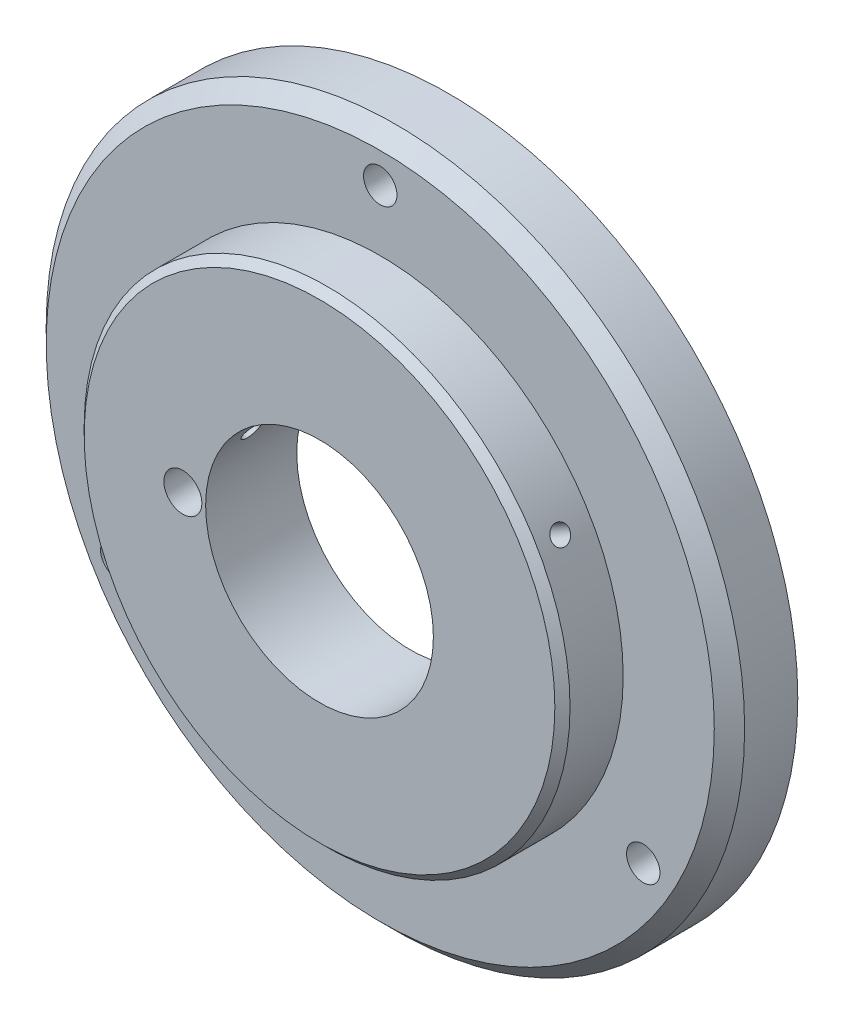
ISO-10303-21;
HEADER;
FILE_DESCRIPTION(('STEP AP214'),'2;1');
FILE_NAME('part.step','',(''),(''),'','','');
FILE_SCHEMA(('AUTOMOTIVE_DESIGN { 1 0 10303 214 1 1 1 1 }'));
ENDSEC;
DATA;
#1=APPLICATION_CONTEXT('core data for automotive mechanical design processes');
#2=APPLICATION_PROTOCOL_DEFINITION('international standard','automotive_design',2000,#1);
#3=PRODUCT_CONTEXT('',#1,'mechanical');
#4=PRODUCT('Part','Part','',(#3));
#5=PRODUCT_RELATED_PRODUCT_CATEGORY('part','',(#4));
#6=PRODUCT_DEFINITION_FORMATION('','',#4);
#7=PRODUCT_DEFINITION_CONTEXT('part definition',#1,'design');
#8=PRODUCT_DEFINITION('design','',#6,#7);
#9=PRODUCT_DEFINITION_SHAPE('','',#8);
#10=(LENGTH_UNIT() NAMED_UNIT(*) SI_UNIT(.MILLI.,.METRE.));
#11=(NAMED_UNIT(*) PLANE_ANGLE_UNIT() SI_UNIT($,.RADIAN.));
#12=(NAMED_UNIT(*) SI_UNIT($,.STERADIAN.) SOLID_ANGLE_UNIT());
#13=UNCERTAINTY_MEASURE_WITH_UNIT(LENGTH_MEASURE(1.E-05),#10,'distance_accuracy_value','');
#14=(GEOMETRIC_REPRESENTATION_CONTEXT(3) GLOBAL_UNCERTAINTY_ASSIGNED_CONTEXT((#13)) GLOBAL_UNIT_ASSIGNED_CONTEXT((#10,
#11,#12)) REPRESENTATION_CONTEXT('',''));
#15=CARTESIAN_POINT('',(0.,0.,0.));
#16=DIRECTION('',(0.,0.,1.));
#17=DIRECTION('',(1.,0.,0.));
#18=AXIS2_PLACEMENT_3D('',#15,#16,#17);
#19=CARTESIAN_POINT('',(0.,0.,9.));
#20=DIRECTION('',(0.,0.,1.));
#21=DIRECTION('',(1.,0.,0.));
#22=AXIS2_PLACEMENT_3D('',#19,#20,#21);
#23=PLANE('',#22);
#24=CARTESIAN_POINT('',(0.,0.,9.));
#25=DIRECTION('',(0.,0.,1.));
#26=DIRECTION('',(1.,0.,0.));
#27=AXIS2_PLACEMENT_3D('',#24,#25,#26);
#28=CIRCLE('',#27,44.);
#29=CARTESIAN_POINT('',(44.,0.,9.));
#30=VERTEX_POINT('',#29);
#31=EDGE_CURVE('E51',#30,#30,#28,.T.);
#32=ORIENTED_EDGE('',*,*,#31,.T.);
#33=EDGE_LOOP('',(#32));
#34=FACE_BOUND('',#33,.T.);
#35=CARTESIAN_POINT('',(-34.6410161513777,-19.9999999999997,9.));
#36=DIRECTION('',(0.,0.,1.));
#37=DIRECTION('',(-0.499999999999992,0.866025403784443,0.));
#38=AXIS2_PLACEMENT_3D('',#35,#36,#37);
#39=CIRCLE('',#38,2.2);
#40=CARTESIAN_POINT('',(-35.7410161513777,-18.0947441116739,9.));
#41=VERTEX_POINT('',#40);
#42=EDGE_CURVE('E85',#41,#41,#39,.T.);
#43=ORIENTED_EDGE('',*,*,#42,.F.);
#44=EDGE_LOOP('',(#43));
#45=FACE_BOUND('',#44,.T.);
#46=CARTESIAN_POINT('',(34.6410161513775,-20.0000000000002,9.));
#47=DIRECTION('',(0.,0.,1.));
#48=DIRECTION('',(-0.500000000000004,-0.866025403784436,0.));
#49=AXIS2_PLACEMENT_3D('',#46,#47,#48);
#50=CIRCLE('',#49,2.2);
#51=CARTESIAN_POINT('',(33.5410161513775,-21.9052558883259,9.));
#52=VERTEX_POINT('',#51);
#53=EDGE_CURVE('E79',#52,#52,#50,.T.);
#54=ORIENTED_EDGE('',*,*,#53,.F.);
#55=EDGE_LOOP('',(#54));
#56=FACE_BOUND('',#55,.T.);
#57=CARTESIAN_POINT('',(0.,40.,9.));
#58=DIRECTION('',(0.,0.,1.));
#59=DIRECTION('',(1.,0.,0.));
#60=AXIS2_PLACEMENT_3D('',#57,#58,#59);
#61=CIRCLE('',#60,2.2);
#62=CARTESIAN_POINT('',(2.2,40.,9.));
#63=VERTEX_POINT('',#62);
#64=EDGE_CURVE('E73',#63,#63,#61,.T.);
#65=ORIENTED_EDGE('',*,*,#64,.F.);
#66=EDGE_LOOP('',(#65));
#67=FACE_BOUND('',#66,.T.);
#68=CARTESIAN_POINT('',(0.,0.,9.));
#69=DIRECTION('',(0.,0.,1.));
#70=DIRECTION('',(1.,0.,0.));
#71=AXIS2_PLACEMENT_3D('',#68,#69,#70);
#72=CIRCLE('',#71,32.);
#73=CARTESIAN_POINT('',(32.,0.,9.));
#74=VERTEX_POINT('',#73);
#75=EDGE_CURVE('E57',#74,#74,#72,.T.);
#76=ORIENTED_EDGE('',*,*,#75,.F.);
#77=EDGE_LOOP('',(#76));
#78=FACE_BOUND('',#77,.T.);
#79=ADVANCED_FACE('F34',(#34,#45,#56,#67,#78),#23,.T.);
#80=CARTESIAN_POINT('',(0.,0.,9.));
#81=DIRECTION('',(0.,0.,-1.));
#82=DIRECTION('',(-1.,0.,0.));
#83=AXIS2_PLACEMENT_3D('',#80,#81,#82);
#84=CYLINDRICAL_SURFACE('',#83,46.);
#85=CARTESIAN_POINT('',(0.,0.,7.));
#86=DIRECTION('',(0.,0.,1.));
#87=DIRECTION('',(1.,0.,0.));
#88=AXIS2_PLACEMENT_3D('',#85,#86,#87);
#89=CIRCLE('',#88,46.);
#90=CARTESIAN_POINT('',(46.,0.,7.));
#91=VERTEX_POINT('',#90);
#92=EDGE_CURVE('E46',#91,#91,#89,.F.);
#93=ORIENTED_EDGE('',*,*,#92,.T.);
#94=EDGE_LOOP('',(#93));
#95=FACE_BOUND('',#94,.T.);
#96=CARTESIAN_POINT('',(0.,0.,0.));
#97=DIRECTION('',(0.,0.,1.));
#98=DIRECTION('',(1.,0.,0.));
#99=AXIS2_PLACEMENT_3D('',#96,#97,#98);
#100=CIRCLE('',#99,46.);
#101=CARTESIAN_POINT('',(46.,0.,0.));
#102=VERTEX_POINT('',#101);
#103=EDGE_CURVE('E54',#102,#102,#100,.T.);
#104=ORIENTED_EDGE('',*,*,#103,.T.);
#105=EDGE_LOOP('',(#104));
#106=FACE_BOUND('',#105,.T.);
#107=ADVANCED_FACE('F144',(#95,#106),#84,.T.);
#108=CARTESIAN_POINT('',(0.,0.,0.));
#109=DIRECTION('',(0.,0.,1.));
#110=DIRECTION('',(1.,0.,0.));
#111=AXIS2_PLACEMENT_3D('',#108,#109,#110);
#112=PLANE('',#111);
#113=CARTESIAN_POINT('',(-34.6410161513777,-19.9999999999997,0.));
#114=DIRECTION('',(0.,0.,1.));
#115=DIRECTION('',(-0.499999999999992,0.866025403784443,0.));
#116=AXIS2_PLACEMENT_3D('',#113,#114,#115);
#117=CIRCLE('',#116,2.2);
#118=CARTESIAN_POINT('',(-35.7410161513777,-18.0947441116739,0.));
#119=VERTEX_POINT('',#118);
#120=EDGE_CURVE('E82',#119,#119,#117,.T.);
#121=ORIENTED_EDGE('',*,*,#120,.T.);
#122=EDGE_LOOP('',(#121));
#123=FACE_BOUND('',#122,.T.);
#124=CARTESIAN_POINT('',(34.6410161513775,-20.0000000000002,0.));
#125=DIRECTION('',(0.,0.,1.));
#126=DIRECTION('',(-0.500000000000004,-0.866025403784436,0.));
#127=AXIS2_PLACEMENT_3D('',#124,#125,#126);
#128=CIRCLE('',#127,2.2);
#129=CARTESIAN_POINT('',(33.5410161513775,-21.9052558883259,0.));
#130=VERTEX_POINT('',#129);
#131=EDGE_CURVE('E76',#130,#130,#128,.T.);
#132=ORIENTED_EDGE('',*,*,#131,.T.);
#133=EDGE_LOOP('',(#132));
#134=FACE_BOUND('',#133,.T.);
#135=CARTESIAN_POINT('',(0.,40.,0.));
#136=DIRECTION('',(0.,0.,1.));
#137=DIRECTION('',(1.,0.,0.));
#138=AXIS2_PLACEMENT_3D('',#135,#136,#137);
#139=CIRCLE('',#138,2.2);
#140=CARTESIAN_POINT('',(2.2,40.,0.));
#141=VERTEX_POINT('',#140);
#142=EDGE_CURVE('E70',#141,#141,#139,.T.);
#143=ORIENTED_EDGE('',*,*,#142,.T.);
#144=EDGE_LOOP('',(#143));
#145=FACE_BOUND('',#144,.T.);
#146=CARTESIAN_POINT('',(0.,0.,0.));
#147=DIRECTION('',(0.,0.,-1.));
#148=DIRECTION('',(-1.,0.,0.));
#149=AXIS2_PLACEMENT_3D('',#146,#147,#148);
#150=CIRCLE('',#149,26.);
#151=CARTESIAN_POINT('',(-26.,0.,0.));
#152=VERTEX_POINT('',#151);
#153=EDGE_CURVE('E61',#152,#152,#150,.T.);
#154=ORIENTED_EDGE('',*,*,#153,.F.);
#155=EDGE_LOOP('',(#154));
#156=FACE_BOUND('',#155,.T.);
#157=ORIENTED_EDGE('',*,*,#103,.F.);
#158=EDGE_LOOP('',(#157));
#159=FACE_BOUND('',#158,.T.);
#160=ADVANCED_FACE('F140',(#123,#134,#145,#156,#159),#112,.F.);
#161=CARTESIAN_POINT('',(0.,0.,17.));
#162=DIRECTION('',(0.,0.,-1.));
#163=DIRECTION('',(-1.,0.,0.));
#164=AXIS2_PLACEMENT_3D('',#161,#162,#163);
#165=CYLINDRICAL_SURFACE('',#164,32.);
#166=CARTESIAN_POINT('',(-28.3049995486143,14.92739094929,13.));
#167=CARTESIAN_POINT('',(-28.3049983013567,14.9273937416056,13.0687817346013));
#168=CARTESIAN_POINT('',(-28.3022875957141,14.9325368080575,13.1376127007864));
#169=CARTESIAN_POINT('',(-28.2914961853581,14.9529720110016,13.2733771365377));
#170=CARTESIAN_POINT('',(-28.2834090969755,14.9682762123288,13.3403082516841));
#171=CARTESIAN_POINT('',(-28.262048613331,15.008568390377,13.4702865713771));
#172=CARTESIAN_POINT('',(-28.2487777929265,15.0335515593219,13.533335686215));
#173=CARTESIAN_POINT('',(-28.217357464949,15.0924433461171,13.6537757279041));
#174=CARTESIAN_POINT('',(-28.1992091343826,15.1263498106193,13.7111680152607));
#175=CARTESIAN_POINT('',(-28.1584451993501,15.2020988472639,13.8187201634661));
#176=CARTESIAN_POINT('',(-28.1358270877819,15.2439458727436,13.8688759379111));
#177=CARTESIAN_POINT('',(-28.0866724815605,15.3343232440568,13.9604966941986));
#178=CARTESIAN_POINT('',(-28.0601358295691,15.3828538582462,14.0019613269103));
#179=CARTESIAN_POINT('',(-28.0037946901089,15.4851829222492,14.0750318070124));
#180=CARTESIAN_POINT('',(-27.9739892617414,15.5389828883366,14.1066348056686));
#181=CARTESIAN_POINT('',(-27.9118830791877,15.6502664244368,14.1590665405304));
#182=CARTESIAN_POINT('',(-27.8795823381416,15.7077499750518,14.1798953334679));
#183=CARTESIAN_POINT('',(-27.8133632815626,15.8247064501016,14.2101775270137));
#184=CARTESIAN_POINT('',(-27.779445773912,15.8841783766191,14.2196365483016));
#185=CARTESIAN_POINT('',(-27.7109156913184,16.0034333943823,14.2269280231671));
#186=CARTESIAN_POINT('',(-27.6763031201031,16.063216483958,14.2247605390816));
#187=CARTESIAN_POINT('',(-27.6073907342089,16.1813674616062,14.2088652324668));
#188=CARTESIAN_POINT('',(-27.573090765164,16.2397360747586,14.1951434675457));
#189=CARTESIAN_POINT('',(-27.5057961475346,16.3534567185034,14.1565384898046));
#190=CARTESIAN_POINT('',(-27.4728015027454,16.4088087403255,14.1316552445362));
#191=CARTESIAN_POINT('',(-27.4091096027486,16.5149795200087,14.071426713911));
#192=CARTESIAN_POINT('',(-27.3784129586265,16.5657970727463,14.0360786580408));
#193=CARTESIAN_POINT('',(-27.3202815967972,16.6614931257471,13.9559259482309));
#194=CARTESIAN_POINT('',(-27.2928468920548,16.7063716024053,13.9111212567074));
#195=CARTESIAN_POINT('',(-27.2420959965874,16.7890012741705,13.8132928451493));
#196=CARTESIAN_POINT('',(-27.2187824597205,16.8267478777217,13.7602638699825));
#197=CARTESIAN_POINT('',(-27.1770530379904,16.8940629148845,13.6475106960367));
#198=CARTESIAN_POINT('',(-27.1586371540793,16.9236313469063,13.5877864959562));
#199=CARTESIAN_POINT('',(-27.1273112044258,16.9737993937542,13.4633351612558));
#200=CARTESIAN_POINT('',(-27.1144012337773,16.9943988536751,13.3986079402503));
#201=CARTESIAN_POINT('',(-27.0945198283844,17.0260784693013,13.2659893169949));
#202=CARTESIAN_POINT('',(-27.0875483674093,17.0371586670534,13.1980979287225));
#203=CARTESIAN_POINT('',(-27.0797817491522,17.0495007181364,13.0611243202513));
#204=CARTESIAN_POINT('',(-27.0789826742475,17.0507687992333,12.9920428832917));
#205=CARTESIAN_POINT('',(-27.0835775327228,17.0434693039088,12.8546095938781));
#206=CARTESIAN_POINT('',(-27.0889714542317,17.0349017463408,12.7862577400258));
#207=CARTESIAN_POINT('',(-27.1057676239354,17.0081629842464,12.6522444390824));
#208=CARTESIAN_POINT('',(-27.1171680943727,16.9899946212646,12.5865822021398));
#209=CARTESIAN_POINT('',(-27.1455943400434,16.9445396026231,12.4597877638274));
#210=CARTESIAN_POINT('',(-27.1626201341274,16.9172529164078,12.3986555776388));
#211=CARTESIAN_POINT('',(-27.2017433322741,16.8542733281679,12.2826227072665));
#212=CARTESIAN_POINT('',(-27.2238432924148,16.8185761891949,12.2277251846564));
#213=CARTESIAN_POINT('',(-27.2723893093669,16.7397406967326,12.1257517540582));
#214=CARTESIAN_POINT('',(-27.2988353831568,16.6966023141732,12.0786758766278));
#215=CARTESIAN_POINT('',(-27.3552419692377,16.6040257392653,11.9936574483767));
#216=CARTESIAN_POINT('',(-27.3852042948371,16.5545842953243,11.9557196410543));
#217=CARTESIAN_POINT('',(-27.4476930805627,16.4507692919427,11.8900866901772));
#218=CARTESIAN_POINT('',(-27.4802195329994,16.3963957472929,11.8623915159073));
#219=CARTESIAN_POINT('',(-27.5468324212783,16.2842338859241,11.8180383124666));
#220=CARTESIAN_POINT('',(-27.5809184219398,16.2264465205122,11.801377224154));
#221=CARTESIAN_POINT('',(-27.6496448163369,16.1090584915163,11.7795551141235));
#222=CARTESIAN_POINT('',(-27.6842852086535,16.0494578325732,11.7743940629749));
#223=CARTESIAN_POINT('',(-27.7530989114255,15.9301675861921,11.775718874063));
#224=CARTESIAN_POINT('',(-27.7872725068437,15.8704780801664,11.7821972783576));
#225=CARTESIAN_POINT('',(-27.8542233522955,15.7526770210819,11.8066017284926));
#226=CARTESIAN_POINT('',(-27.8870005996042,15.6945654711025,11.8245277966713));
#227=CARTESIAN_POINT('',(-27.9502782413008,15.5815962442221,11.8713174142083));
#228=CARTESIAN_POINT('',(-27.9807786032152,15.5267386137314,11.9001811195264));
#229=CARTESIAN_POINT('',(-28.0387109921327,15.4218766295864,11.9680248713286));
#230=CARTESIAN_POINT('',(-28.0661431241071,15.3718721099036,12.0070045715696));
#231=CARTESIAN_POINT('',(-28.117268497975,15.2781565770395,12.093998653145));
#232=CARTESIAN_POINT('',(-28.1409597373999,15.234448935614,12.1420178432989));
#233=CARTESIAN_POINT('',(-28.1840175462792,15.154643416685,12.2457319580333));
#234=CARTESIAN_POINT('',(-28.2033830458871,15.1185474218251,12.301428775957));
#235=CARTESIAN_POINT('',(-28.2373381026415,15.0550336755756,12.4189466360042));
#236=CARTESIAN_POINT('',(-28.251924031238,15.0276225180524,12.480772284843));
#237=CARTESIAN_POINT('',(-28.27595039224,14.9823660388844,12.6087129367533));
#238=CARTESIAN_POINT('',(-28.2853969401694,14.9645093484738,12.6748227366231));
#239=CARTESIAN_POINT('',(-28.2964381247257,14.9436162500752,12.7844564585058));
#240=CARTESIAN_POINT('',(-28.2996453017304,14.9375398639545,12.827269277635));
#241=CARTESIAN_POINT('',(-28.3039264059179,14.9294263352423,12.9133815553891));
#242=CARTESIAN_POINT('',(-28.3050003341416,14.9273891906795,12.9566810137763));
#243=CARTESIAN_POINT('',(-28.3049995486143,14.92739094929,13.));
#244=B_SPLINE_CURVE_WITH_KNOTS('',3,(#166,#167,#168,#169,#170,#171,#172,#173,#174,#175,#176,
#177,#178,#179,#180,#181,#182,#183,#184,#185,#186,#187,#188,#189,#190,#191,#192,#193,#194,#195,
#196,#197,#198,#199,#200,#201,#202,#203,#204,#205,#206,#207,#208,#209,#210,#211,#212,#213,#214,
#215,#216,#217,#218,#219,#220,#221,#222,#223,#224,#225,#226,#227,#228,#229,#230,#231,#232,#233,
#234,#235,#236,#237,#238,#239,#240,#241,#242,#243),.UNSPECIFIED.,.T.,.F.,(4,2,2,2,2,2,2,2,2,2,2,
2,2,2,2,2,2,2,2,2,2,2,2,2,2,2,2,2,2,2,2,2,2,2,2,2,2,2,4),(0.,0.206187080004386,
0.412619415335633,0.618949341960605,0.825229523130307,1.03162573703227,1.23803024046186,
1.44449431296398,1.65095729831371,1.85731817605756,2.06367794737312,2.26992959695209,
2.47618184614542,2.68248874863491,2.88879647106754,3.09523656678553,3.30167670263388,
3.50812040381157,3.71456319311665,3.92087494209924,4.12718629561428,4.33343662145748,
4.53968763845891,4.74604278190158,4.95239873151231,5.15886156909222,5.3653237875384,
5.57172874144185,5.77813316711757,5.98440538701568,6.1906780094248,6.3969535731837,
6.60322207761985,6.80960062427798,7.01603015631957,7.22261604419479,7.42895556782024,
7.5588130029242,7.68867037465197),.UNSPECIFIED.);
#245=CARTESIAN_POINT('',(-28.3049995486143,14.92739094929,13.));
#246=VERTEX_POINT('',#245);
#247=EDGE_CURVE('E206',#246,#246,#244,.T.);
#248=ORIENTED_EDGE('',*,*,#247,.F.);
#249=EDGE_LOOP('',(#248));
#250=FACE_BOUND('',#249,.T.);
#251=CARTESIAN_POINT('',(27.0799995486143,17.0491531885619,13.));
#252=CARTESIAN_POINT('',(27.0800013432017,17.0491507122473,13.0687817346013));
#253=CARTESIAN_POINT('',(27.0831000165812,17.0442316390727,13.1376127007864));
#254=CARTESIAN_POINT('',(27.0954017162842,17.0246684020897,13.2733771365377));
#255=CARTESIAN_POINT('',(27.1046119992269,17.0100126774442,13.3403082516841));
#256=CARTESIAN_POINT('',(27.1288258071681,16.9713678669468,13.4702865713771));
#257=CARTESIAN_POINT('',(27.1438264559392,16.947383414875,13.533335686215));
#258=CARTESIAN_POINT('',(27.1791180753894,16.8907267192536,13.6537757279041));
#259=CARTESIAN_POINT('',(27.1994077697177,16.8580565716957,13.7111680152607));
#260=CARTESIAN_POINT('',(27.2446263922478,16.7848794500771,13.8187201634661));
#261=CARTESIAN_POINT('',(27.2695579236019,16.7443680781335,13.8688759379111));
#262=CARTESIAN_POINT('',(27.3232497199757,16.6566102547762,13.9604966941986));
#263=CARTESIAN_POINT('',(27.3520101387293,16.6093635329255,14.0019613269103));
#264=CARTESIAN_POINT('',(27.4124591379712,16.5094061428733,14.0750318070124));
#265=CARTESIAN_POINT('',(27.444148561142,16.4566939016928,14.1066348056686));
#266=CARTESIAN_POINT('',(27.5094698391508,16.3472666018191,14.1590665405304));
#267=CARTESIAN_POINT('',(27.5431016837601,16.2905515642046,14.1798953334679));
#268=CARTESIAN_POINT('',(27.6112794340008,16.1747259414676,14.2101775270137));
#269=CARTESIAN_POINT('',(27.6458248793517,16.1156165549504,14.2196365483016));
#270=CARTESIAN_POINT('',(27.7148377129666,15.9966402536192,14.2269280231671));
#271=CARTESIAN_POINT('',(27.7493051016482,15.9367733428686,14.2247605390816));
#272=CARTESIAN_POINT('',(27.8171706568264,15.8180179772248,14.2088652324668));
#273=CARTESIAN_POINT('',(27.8505693740776,15.7591290261067,14.1951434675457));
#274=CARTESIAN_POINT('',(27.9154070316806,15.6439898558293,14.1565384898046));
#275=CARTESIAN_POINT('',(27.9468459663348,15.587739644342,14.1316552445362));
#276=CARTESIAN_POINT('',(28.0069466086816,15.4794954510878,14.071426713911));
#277=CARTESIAN_POINT('',(28.0356075782495,15.4275026010983,14.0360786580408));
#278=CARTESIAN_POINT('',(28.0894171102754,15.3293113384972,13.9559259482309));
#279=CARTESIAN_POINT('',(28.1145656587734,15.2831129489158,13.9111212567074));
#280=CARTESIAN_POINT('',(28.1607496058948,15.1978465482937,13.8132928451493));
#281=CARTESIAN_POINT('',(28.1817823550432,15.1587831313393,13.7602638699825));
#282=CARTESIAN_POINT('',(28.2192141764178,15.0889868734544,13.6475106960367));
#283=CARTESIAN_POINT('',(28.2356132477433,15.0582540341433,13.5877864959562));
#284=CARTESIAN_POINT('',(28.263397075945,15.0060409425218,13.4633351612558));
#285=CARTESIAN_POINT('',(28.2747817462165,14.9845608500176,13.3986079402503));
#286=CARTESIAN_POINT('',(28.2922763954345,14.9515032400712,13.2659893169949));
#287=CARTESIAN_POINT('',(28.2983863976792,14.9399256788893,13.1980979287225));
#288=CARTESIAN_POINT('',(28.3051916183234,14.9270285646357,13.0611243202513));
#289=CARTESIAN_POINT('',(28.305890271315,14.9257025049202,12.9920428832917));
#290=CARTESIAN_POINT('',(28.3018661521667,14.9333315167489,12.8546095938781));
#291=CARTESIAN_POINT('',(28.2971433904189,14.9422865685856,12.7862577400258));
#292=CARTESIAN_POINT('',(28.2823850280314,14.9702018592825,12.6522444390824));
#293=CARTESIAN_POINT('',(28.2723509993625,14.9891591377872,12.5865822021398));
#294=CARTESIAN_POINT('',(28.2471989213249,15.0365044979929,12.4597877638274));
#295=CARTESIAN_POINT('',(28.2320808549193,15.0648926112969,12.3986555776388));
#296=CARTESIAN_POINT('',(28.1971005306571,15.1302640888893,12.2826227072665));
#297=CARTESIAN_POINT('',(28.1772358815344,15.1672517852802,12.2277251846564));
#298=CARTESIAN_POINT('',(28.1332353508181,15.2487116154444,12.1257517540582));
#299=CARTESIAN_POINT('',(28.1090994525385,15.2931837784566,12.0786758766279));
#300=CARTESIAN_POINT('',(28.0571290799134,15.3883216023973,11.9936574483767));
#301=CARTESIAN_POINT('',(28.0292926962604,15.4389904594934,11.9557196410543));
#302=CARTESIAN_POINT('',(27.9706306589008,15.5450148370742,11.8900866901772));
#303=CARTESIAN_POINT('',(27.9398050141586,15.6003703435043,11.8623915159073));
#304=CARTESIAN_POINT('',(27.8759764370168,15.7141397276576,11.8180383124666));
#305=CARTESIAN_POINT('',(27.8429741108831,15.7725527528499,11.801377224154));
#306=CARTESIAN_POINT('',(27.7756762928711,15.8907655708062,11.7795551141235));
#307=CARTESIAN_POINT('',(27.7413808043023,15.9505653600209,11.7743940629749));
#308=CARTESIAN_POINT('',(27.6724792718986,16.0698048979405,11.775718874063));
#309=CARTESIAN_POINT('',(27.6378734410501,16.1292448527242,11.7821972783576));
#310=CARTESIAN_POINT('',(27.5693301540161,16.2461265152325,11.8066017284926));
#311=CARTESIAN_POINT('',(27.5353926991351,16.3035682190577,11.8245277966713));
#312=CARTESIAN_POINT('',(27.469197299659,16.4148528776987,11.8713174142083));
#313=CARTESIAN_POINT('',(27.4369393790199,16.4686957811865,11.9001811195264));
#314=CARTESIAN_POINT('',(27.3750924313178,16.5712976937636,11.9680248713286));
#315=CARTESIAN_POINT('',(27.3455033129556,16.6200568767748,12.0070045715696));
#316=CARTESIAN_POINT('',(27.2899059677001,16.7111905157544,12.093998653145));
#317=CARTESIAN_POINT('',(27.2638996595986,16.7535615516563,12.1420178432989));
#318=CARTESIAN_POINT('',(27.2163149572835,16.8307534674415,12.2457319580333));
#319=CARTESIAN_POINT('',(27.1947376585639,16.8655724794888,12.301428775957));
#320=CARTESIAN_POINT('',(27.1567106691995,16.9267352943499,12.4189466360042));
#321=CARTESIAN_POINT('',(27.1402648747356,16.9530726578138,12.480772284843));
#322=CARTESIAN_POINT('',(27.1130847945912,16.9965083363861,12.6087129367533));
#323=CARTESIAN_POINT('',(27.1023437210328,17.0136176320763,12.6748227366231));
#324=CARTESIAN_POINT('',(27.089770359334,17.0336261275892,12.7844564585058));
#325=CARTESIAN_POINT('',(27.0861116430926,17.0394418174101,12.827269277635));
#326=CARTESIAN_POINT('',(27.0812256732073,17.0472061267488,12.9133815553891));
#327=CARTESIAN_POINT('',(27.0799984183766,17.0491547481538,12.9566810137763));
#328=CARTESIAN_POINT('',(27.0799995486143,17.0491531885619,13.));
#329=B_SPLINE_CURVE_WITH_KNOTS('',3,(#251,#252,#253,#254,#255,#256,#257,#258,#259,#260,#261,
#262,#263,#264,#265,#266,#267,#268,#269,#270,#271,#272,#273,#274,#275,#276,#277,#278,#279,#280,
#281,#282,#283,#284,#285,#286,#287,#288,#289,#290,#291,#292,#293,#294,#295,#296,#297,#298,#299,
#300,#301,#302,#303,#304,#305,#306,#307,#308,#309,#310,#311,#312,#313,#314,#315,#316,#317,#318,
#319,#320,#321,#322,#323,#324,#325,#326,#327,#328),.UNSPECIFIED.,.T.,.F.,(4,2,2,2,2,2,2,2,2,2,2,
2,2,2,2,2,2,2,2,2,2,2,2,2,2,2,2,2,2,2,2,2,2,2,2,2,2,2,4),(0.,0.206187080004389,
0.412619415335631,0.618949341960605,0.825229523130309,1.03162573703227,1.23803024046186,
1.44449431296398,1.65095729831372,1.85731817605757,2.06367794737312,2.26992959695208,
2.47618184614542,2.68248874863491,2.88879647106755,3.09523656678552,3.30167670263387,
3.50812040381157,3.71456319311664,3.92087494209924,4.12718629561427,4.33343662145747,
4.5396876384589,4.74604278190158,4.95239873151231,5.15886156909222,5.36532378753841,
5.57172874144186,5.77813316711757,5.98440538701568,6.19067800942481,6.39695357318371,
6.60322207761986,6.80960062427799,7.01603015631957,7.22261604419479,7.42895556782025,
7.55881300292421,7.68867037465198),.UNSPECIFIED.);
#330=CARTESIAN_POINT('',(27.0799995486143,17.0491531885619,13.));
#331=VERTEX_POINT('',#330);
#332=EDGE_CURVE('E88',#331,#331,#329,.T.);
#333=ORIENTED_EDGE('',*,*,#332,.F.);
#334=EDGE_LOOP('',(#333));
#335=FACE_BOUND('',#334,.T.);
#336=CARTESIAN_POINT('',(0.,0.,16.));
#337=DIRECTION('',(0.,0.,1.));
#338=DIRECTION('',(1.,0.,0.));
#339=AXIS2_PLACEMENT_3D('',#336,#337,#338);
#340=CIRCLE('',#339,32.);
#341=CARTESIAN_POINT('',(32.,0.,16.));
#342=VERTEX_POINT('',#341);
#343=EDGE_CURVE('E10',#342,#342,#340,.F.);
#344=ORIENTED_EDGE('',*,*,#343,.T.);
#345=EDGE_LOOP('',(#344));
#346=FACE_BOUND('',#345,.T.);
#347=ORIENTED_EDGE('',*,*,#75,.T.);
#348=EDGE_LOOP('',(#347));
#349=FACE_BOUND('',#348,.T.);
#350=ADVANCED_FACE('F136',(#250,#335,#346,#349),#165,.T.);
#351=CARTESIAN_POINT('',(0.,0.,17.));
#352=DIRECTION('',(0.,0.,1.));
#353=DIRECTION('',(1.,0.,0.));
#354=AXIS2_PLACEMENT_3D('',#351,#352,#353);
#355=PLANE('',#354);
#356=CARTESIAN_POINT('',(-18.,0.,17.));
#357=DIRECTION('',(0.,0.,1.));
#358=DIRECTION('',(1.,0.,0.));
#359=AXIS2_PLACEMENT_3D('',#356,#357,#358);
#360=CIRCLE('',#359,2.5);
#361=CARTESIAN_POINT('',(-15.5,0.,17.));
#362=VERTEX_POINT('',#361);
#363=EDGE_CURVE('E237',#362,#362,#360,.T.);
#364=ORIENTED_EDGE('',*,*,#363,.F.);
#365=EDGE_LOOP('',(#364));
#366=FACE_BOUND('',#365,.T.);
#367=CARTESIAN_POINT('',(0.,0.,17.));
#368=DIRECTION('',(0.,0.,1.));
#369=DIRECTION('',(1.,0.,0.));
#370=AXIS2_PLACEMENT_3D('',#367,#368,#369);
#371=CIRCLE('',#370,31.);
#372=CARTESIAN_POINT('',(31.,0.,17.));
#373=VERTEX_POINT('',#372);
#374=EDGE_CURVE('E42',#373,#373,#371,.T.);
#375=ORIENTED_EDGE('',*,*,#374,.T.);
#376=EDGE_LOOP('',(#375));
#377=FACE_BOUND('',#376,.T.);
#378=CARTESIAN_POINT('',(0.,0.,17.));
#379=DIRECTION('',(0.,0.,-1.));
#380=DIRECTION('',(-1.,0.,0.));
#381=AXIS2_PLACEMENT_3D('',#378,#379,#380);
#382=CIRCLE('',#381,15.);
#383=CARTESIAN_POINT('',(-15.,0.,17.));
#384=VERTEX_POINT('',#383);
#385=EDGE_CURVE('E64',#384,#384,#382,.T.);
#386=ORIENTED_EDGE('',*,*,#385,.T.);
#387=EDGE_LOOP('',(#386));
#388=FACE_BOUND('',#387,.T.);
#389=ADVANCED_FACE('F132',(#366,#377,#388),#355,.T.);
#390=CARTESIAN_POINT('',(0.,0.,5.));
#391=DIRECTION('',(0.,0.,-1.));
#392=DIRECTION('',(-1.,0.,0.));
#393=AXIS2_PLACEMENT_3D('',#390,#391,#392);
#394=CYLINDRICAL_SURFACE('',#393,26.);
#395=CARTESIAN_POINT('',(0.,0.,5.));
#396=DIRECTION('',(0.,0.,-1.));
#397=DIRECTION('',(-1.,0.,0.));
#398=AXIS2_PLACEMENT_3D('',#395,#396,#397);
#399=CIRCLE('',#398,26.);
#400=CARTESIAN_POINT('',(-26.,0.,5.));
#401=VERTEX_POINT('',#400);
#402=EDGE_CURVE('E60',#401,#401,#399,.T.);
#403=ORIENTED_EDGE('',*,*,#402,.F.);
#404=EDGE_LOOP('',(#403));
#405=FACE_BOUND('',#404,.T.);
#406=ORIENTED_EDGE('',*,*,#153,.T.);
#407=EDGE_LOOP('',(#406));
#408=FACE_BOUND('',#407,.T.);
#409=ADVANCED_FACE('F128',(#405,#408),#394,.F.);
#410=CARTESIAN_POINT('',(0.,0.,5.));
#411=DIRECTION('',(0.,0.,-1.));
#412=DIRECTION('',(-1.,0.,0.));
#413=AXIS2_PLACEMENT_3D('',#410,#411,#412);
#414=PLANE('',#413);
#415=CARTESIAN_POINT('',(-18.,0.,5.));
#416=DIRECTION('',(0.,0.,-1.));
#417=DIRECTION('',(-1.,0.,0.));
#418=AXIS2_PLACEMENT_3D('',#415,#416,#417);
#419=CIRCLE('',#418,2.5);
#420=CARTESIAN_POINT('',(-20.5,0.,5.));
#421=VERTEX_POINT('',#420);
#422=EDGE_CURVE('E38',#421,#421,#419,.T.);
#423=ORIENTED_EDGE('',*,*,#422,.F.);
#424=EDGE_LOOP('',(#423));
#425=FACE_BOUND('',#424,.T.);
#426=CARTESIAN_POINT('',(0.,0.,5.));
#427=DIRECTION('',(0.,0.,-1.));
#428=DIRECTION('',(-1.,0.,0.));
#429=AXIS2_PLACEMENT_3D('',#426,#427,#428);
#430=CIRCLE('',#429,15.);
#431=CARTESIAN_POINT('',(-15.,0.,5.));
#432=VERTEX_POINT('',#431);
#433=EDGE_CURVE('E67',#432,#432,#430,.T.);
#434=ORIENTED_EDGE('',*,*,#433,.F.);
#435=EDGE_LOOP('',(#434));
#436=FACE_BOUND('',#435,.T.);
#437=ORIENTED_EDGE('',*,*,#402,.T.);
#438=EDGE_LOOP('',(#437));
#439=FACE_BOUND('',#438,.T.);
#440=ADVANCED_FACE('F124',(#425,#436,#439),#414,.T.);
#441=CARTESIAN_POINT('',(0.,0.,17.));
#442=DIRECTION('',(0.,0.,-1.));
#443=DIRECTION('',(-1.,0.,0.));
#444=AXIS2_PLACEMENT_3D('',#441,#442,#443);
#445=CYLINDRICAL_SURFACE('',#444,15.);
#446=CARTESIAN_POINT('',(-13.5594892735725,6.41406662265628,13.));
#447=CARTESIAN_POINT('',(-13.559488347698,6.41406955516327,12.9313144216267));
#448=CARTESIAN_POINT('',(-13.5570055119086,6.41932551894691,12.8625819624061));
#449=CARTESIAN_POINT('',(-13.5471033190011,6.44019564306344,12.7270184306726));
#450=CARTESIAN_POINT('',(-13.5396783545706,6.4558215690394,12.6601896079307));
#451=CARTESIAN_POINT('',(-13.5200062530891,6.4969182545386,12.5304164069569));
#452=CARTESIAN_POINT('',(-13.5077618327377,6.52238346756376,12.4674698633889));
#453=CARTESIAN_POINT('',(-13.4786479928455,6.58233647330402,12.3472147010565));
#454=CARTESIAN_POINT('',(-13.4617795683873,6.61682232471085,12.2899048728763));
#455=CARTESIAN_POINT('',(-13.4236594093565,6.69381894304783,12.1823932360871));
#456=CARTESIAN_POINT('',(-13.4023981551934,6.73634712105274,12.1322072706873));
#457=CARTESIAN_POINT('',(-13.3559050229508,6.82806259814478,12.0405040264282));
#458=CARTESIAN_POINT('',(-13.3306729722019,6.87725018680195,11.998987124724));
#459=CARTESIAN_POINT('',(-13.2767110099942,6.98085637997165,11.9257480785857));
#460=CARTESIAN_POINT('',(-13.2479762942031,7.03528214726932,11.8940396032232));
#461=CARTESIAN_POINT('',(-13.1876804793944,7.14766715637119,11.8414049351163));
#462=CARTESIAN_POINT('',(-13.1561194281151,7.20562633848896,11.8204785602973));
#463=CARTESIAN_POINT('',(-13.0910225282056,7.32322561747348,11.7900476145663));
#464=CARTESIAN_POINT('',(-13.0574912805236,7.38286164081161,11.7805174618995));
#465=CARTESIAN_POINT('',(-12.9892888800799,7.50220615430603,11.7730704118476));
#466=CARTESIAN_POINT('',(-12.9546177477728,7.56191464314347,11.7751533061848));
#467=CARTESIAN_POINT('',(-12.8852204214565,7.67956702390573,11.7908522874746));
#468=CARTESIAN_POINT('',(-12.8504945558231,7.73751478366041,11.8044408644831));
#469=CARTESIAN_POINT('',(-12.7819681484882,7.85020011342145,11.842722713393));
#470=CARTESIAN_POINT('',(-12.7481676152978,7.90493765390616,11.8674160873976));
#471=CARTESIAN_POINT('',(-12.6825428995629,8.00980276889789,11.9272372809871));
#472=CARTESIAN_POINT('',(-12.650721107174,8.05992480208001,11.9623774343303));
#473=CARTESIAN_POINT('',(-12.5901715853768,8.15418436510812,12.0420857300478));
#474=CARTESIAN_POINT('',(-12.5614439162205,8.19832177841972,12.0866540559672));
#475=CARTESIAN_POINT('',(-12.508013775381,8.27961168126041,12.1841086426748));
#476=CARTESIAN_POINT('',(-12.4833232988846,8.3167434042367,12.2370188054194));
#477=CARTESIAN_POINT('',(-12.4389738774208,8.38293034887679,12.3495718028442));
#478=CARTESIAN_POINT('',(-12.4193149363666,8.4119855642591,12.4092146427606));
#479=CARTESIAN_POINT('',(-12.3857702024778,8.46129957099988,12.5335566478646));
#480=CARTESIAN_POINT('',(-12.3718850820036,8.48155733790925,12.5982564008873));
#481=CARTESIAN_POINT('',(-12.3504314163139,8.51276721366739,12.7308677048156));
#482=CARTESIAN_POINT('',(-12.3428627436295,8.52371951030494,12.7987791908778));
#483=CARTESIAN_POINT('',(-12.3343535143276,8.53602837036123,12.9356764099025));
#484=CARTESIAN_POINT('',(-12.3333938939844,8.5374125329808,13.0046584773945));
#485=CARTESIAN_POINT('',(-12.3380902450599,8.5306239793174,13.1419230288621));
#486=CARTESIAN_POINT('',(-12.3437461572523,8.5224513485925,13.2102055190954));
#487=CARTESIAN_POINT('',(-12.3614376880891,8.49676987847431,13.3440367747194));
#488=CARTESIAN_POINT('',(-12.3734644889309,8.47927394305652,13.4095891838217));
#489=CARTESIAN_POINT('',(-12.4034259030438,8.43538545375059,13.5362123185452));
#490=CARTESIAN_POINT('',(-12.4213606074163,8.40899276267201,13.5972829750389));
#491=CARTESIAN_POINT('',(-12.4625062670742,8.34789147504562,13.7133620794016));
#492=CARTESIAN_POINT('',(-12.4857291701809,8.3131640377609,13.7683563742924));
#493=CARTESIAN_POINT('',(-12.5365725951547,8.23628955949791,13.8705786699512));
#494=CARTESIAN_POINT('',(-12.5641931897243,8.19414239585593,13.9178065422989));
#495=CARTESIAN_POINT('',(-12.6229193504403,8.10338385443607,14.0032693793248));
#496=CARTESIAN_POINT('',(-12.6540330704143,8.05475730059015,14.0414826292478));
#497=CARTESIAN_POINT('',(-12.7186206491787,7.95237995837388,14.1076825312718));
#498=CARTESIAN_POINT('',(-12.7520944851847,7.89862921947008,14.1356692820821));
#499=CARTESIAN_POINT('',(-12.8202566977986,7.78750653759673,14.1805844090159));
#500=CARTESIAN_POINT('',(-12.8549435420304,7.73013909485493,14.1975262416018));
#501=CARTESIAN_POINT('',(-12.9244834222222,7.61330072140068,14.2199146010079));
#502=CARTESIAN_POINT('',(-12.959336455162,7.55382982879015,14.2253613359422));
#503=CARTESIAN_POINT('',(-13.0280796124283,7.43463927809407,14.2246025011091));
#504=CARTESIAN_POINT('',(-13.0619722431455,7.37492084710326,14.2184307852541));
#505=CARTESIAN_POINT('',(-13.127974174312,7.25678126341386,14.1946808018539));
#506=CARTESIAN_POINT('',(-13.1600834722619,7.19836011253354,14.1771025183222));
#507=CARTESIAN_POINT('',(-13.2217103570306,7.08453015338715,14.1310469096928));
#508=CARTESIAN_POINT('',(-13.2512280795151,7.02912118749487,14.1025701555352));
#509=CARTESIAN_POINT('',(-13.3069986630181,6.92296081822583,14.0355298835521));
#510=CARTESIAN_POINT('',(-13.333251578619,6.87220933698692,13.9969665343922));
#511=CARTESIAN_POINT('',(-13.3820177579515,6.77676074600151,13.910720737681));
#512=CARTESIAN_POINT('',(-13.404520435716,6.73208083817772,13.8630132672248));
#513=CARTESIAN_POINT('',(-13.4452769218401,6.65030989971168,13.7598780534208));
#514=CARTESIAN_POINT('',(-13.4635296989525,6.61322071123682,13.704448441484));
#515=CARTESIAN_POINT('',(-13.495491432514,6.54775112421475,13.5873388720746));
#516=CARTESIAN_POINT('',(-13.50919208118,6.51938665549063,13.5256477520091));
#517=CARTESIAN_POINT('',(-13.531769760483,6.47239469665562,13.3978898600362));
#518=CARTESIAN_POINT('',(-13.5406523465979,6.45375599317606,13.3318282266388));
#519=CARTESIAN_POINT('',(-13.5511982514045,6.43157155261463,13.2211462586354));
#520=CARTESIAN_POINT('',(-13.5543049261581,6.42501686908441,13.1772381202505));
#521=CARTESIAN_POINT('',(-13.5584507342278,6.41626346065912,13.0888932002174));
#522=CARTESIAN_POINT('',(-13.5594898728404,6.41406472460482,13.0444564199238));
#523=CARTESIAN_POINT('',(-13.5594892735725,6.41406662265628,13.));
#524=B_SPLINE_CURVE_WITH_KNOTS('',3,(#446,#447,#448,#449,#450,#451,#452,#453,#454,#455,#456,
#457,#458,#459,#460,#461,#462,#463,#464,#465,#466,#467,#468,#469,#470,#471,#472,#473,#474,#475,
#476,#477,#478,#479,#480,#481,#482,#483,#484,#485,#486,#487,#488,#489,#490,#491,#492,#493,#494,
#495,#496,#497,#498,#499,#500,#501,#502,#503,#504,#505,#506,#507,#508,#509,#510,#511,#512,#513,
#514,#515,#516,#517,#518,#519,#520,#521,#522,#523),.UNSPECIFIED.,.T.,.F.,(4,2,2,2,2,2,2,2,2,2,2,
2,2,2,2,2,2,2,2,2,2,2,2,2,2,2,2,2,2,2,2,2,2,2,2,2,2,2,4),(0.,0.205894418663939,
0.412022843129906,0.61803524020284,0.824003338304828,1.03042255643546,1.23685075314323,
1.44356534646247,1.65027644892585,1.85652265878516,2.06276516967306,2.26851594526201,
2.47426861266825,2.68026516867356,2.8862657353328,3.09286765987674,3.29946974510441,
3.50609588237432,3.71271784973207,3.91874356816173,4.12476744214092,4.330506905353,
4.53624954126972,4.74246171404553,4.94867729626287,5.15538465851986,5.36209002552027,
5.56854308217908,5.77499240105822,5.98084109758255,6.18669008260688,6.39252828526155,
6.59836304615927,6.80476933064397,7.01122564796493,7.21805671126558,7.42464877781758,
7.55791332042347,7.69117752162669),.UNSPECIFIED.);
#525=CARTESIAN_POINT('',(-13.5594892735725,6.41406662265628,13.));
#526=VERTEX_POINT('',#525);
#527=EDGE_CURVE('E208',#526,#526,#524,.T.);
#528=ORIENTED_EDGE('',*,*,#527,.F.);
#529=EDGE_LOOP('',(#528));
#530=FACE_BOUND('',#529,.T.);
#531=CARTESIAN_POINT('',(12.3344892735725,8.53582886192815,13.));
#532=CARTESIAN_POINT('',(12.3344913502608,8.53582659384384,12.9313144216267));
#533=CARTESIAN_POINT('',(12.3378017305241,8.53104841308498,12.8625819624061));
#534=CARTESIAN_POINT('',(12.3509246917354,8.51203780041564,12.7270184306726));
#535=CARTESIAN_POINT('',(12.360744658373,8.49779462960871,12.6601896079306));
#536=CARTESIAN_POINT('',(12.3864993812858,8.46020974723023,12.5304164069569));
#537=CARTESIAN_POINT('',(12.4024306925027,8.43687316163874,12.4674698633889));
#538=CARTESIAN_POINT('',(12.439794598561,8.3816833338203,12.3472147010565));
#539=CARTESIAN_POINT('',(12.4612260097213,8.34983192401423,12.2899048728763));
#540=CARTESIAN_POINT('',(12.5088469576912,8.27832058872873,12.1823932360871));
#541=CARTESIAN_POINT('',(12.5350468131386,8.23864371350477,12.1322072706873));
#542=CARTESIAN_POINT('',(12.5912281800992,8.15252174133509,12.0405040264282));
#543=CARTESIAN_POINT('',(12.6212098560528,8.1060763500684,11.998987124724));
#544=CARTESIAN_POINT('',(12.6839544702233,8.00754082337364,11.9257480785857));
#545=CARTESIAN_POINT('',(12.716721209428,7.95544294587919,11.8940396032232));
#546=CARTESIAN_POINT('',(12.7839015749104,7.84703273396207,11.8414049351163));
#547=CARTESIAN_POINT('',(12.8183151733673,7.79072047072514,11.8204785602973));
#548=CARTESIAN_POINT('',(12.8876106864798,7.67554526220359,11.7900476145663));
#549=CARTESIAN_POINT('',(12.9224913738303,7.61668833822135,11.7805174618995));
#550=CARTESIAN_POINT('',(12.991745554097,7.4979510700908,11.7730704118476));
#551=CARTESIAN_POINT('',(13.0261190560982,7.4380707443162,11.7751533061848));
#552=CARTESIAN_POINT('',(13.0933103434959,7.31914470639046,11.7908522874746));
#553=CARTESIAN_POINT('',(13.1261316427192,7.26009734470614,11.8044408644831));
#554=CARTESIAN_POINT('',(13.1894567972586,7.14440907024353,11.842722713393));
#555=CARTESIAN_POINT('',(13.2199606312638,7.08776817959681,11.8674160873976));
#556=CARTESIAN_POINT('',(13.27796412695,6.9785029511584,11.9272372809871));
#557=CARTESIAN_POINT('',(13.3054601847806,6.92588345396462,11.9623774343303));
#558=CARTESIAN_POINT('',(13.356816600014,6.82631624838719,12.0420857300478));
#559=CARTESIAN_POINT('',(13.380676886621,6.77936865045049,12.0866540559673));
#560=CARTESIAN_POINT('',(13.4243609371324,6.69245183973534,12.1841086426748));
#561=CARTESIAN_POINT('',(13.444172714268,6.6525033983698,12.2370188054194));
#562=CARTESIAN_POINT('',(13.4793175789933,6.58100220041896,12.3495718028442));
#563=CARTESIAN_POINT('',(13.4946506630997,6.54944945036338,12.4092146427606));
#564=CARTESIAN_POINT('',(13.5205854787552,6.49574185528212,12.5335566478646));
#565=CARTESIAN_POINT('',(13.5311866592856,6.47358810476213,12.5982564008873));
#566=CARTESIAN_POINT('',(13.5474883716962,6.43940374739145,12.7308677048156));
#567=CARTESIAN_POINT('',(13.5531890024719,6.4273729362551,12.7987791908778));
#568=CARTESIAN_POINT('',(13.5595941733213,6.41384929748485,12.9356764099025));
#569=CARTESIAN_POINT('',(13.5603130831413,6.41232616057992,13.0046584773945));
#570=CARTESIAN_POINT('',(13.5567821987515,6.41978759674808,13.1419230288622));
#571=CARTESIAN_POINT('',(13.5525324490242,6.42877207575075,13.2102055190954));
#572=CARTESIAN_POINT('',(13.5391374089138,6.45693412594635,13.3440367747194));
#573=CARTESIAN_POINT('',(13.5299988847999,6.4760976087105,13.4095891838217));
#574=CARTESIAN_POINT('',(13.5069710451837,6.52398919911853,13.5362123185452));
#575=CARTESIAN_POINT('',(13.4930816564216,6.55271745425375,13.5972829750389));
#576=CARTESIAN_POINT('',(13.4607392189622,6.61890128458617,13.7133620794016));
#577=CARTESIAN_POINT('',(13.4422758276186,6.65637662726852,13.7683563742924));
#578=CARTESIAN_POINT('',(13.4011222890271,6.73884556404279,13.8705786699512));
#579=CARTESIAN_POINT('',(13.3784320719005,6.78383928242865,13.9178065422989));
#580=CARTESIAN_POINT('',(13.3291959497785,6.88007690018538,14.0032693793248));
#581=CARTESIAN_POINT('',(13.3026409788364,6.93133544901207,14.0414826292478));
#582=CARTESIAN_POINT('',(13.2462733890874,7.03845860409907,14.1076825312718));
#583=CARTESIAN_POINT('',(13.2164608017275,7.09432316589433,14.1356692820821));
#584=CARTESIAN_POINT('',(13.1543068425955,7.20891471453272,14.1805844090159));
#585=CARTESIAN_POINT('',(13.1219686019468,7.2676381241855,14.1975262416018));
#586=CARTESIAN_POINT('',(13.0555535424945,7.38628061373487,14.2199146010079));
#587=CARTESIAN_POINT('',(13.021476755178,7.44619967196491,14.2253613359422));
#588=CARTESIAN_POINT('',(12.9526262890173,7.56532826784194,14.2246025011091));
#589=CARTESIAN_POINT('',(12.9178549260637,7.62453936253952,14.2184307852541));
#590=CARTESIAN_POINT('',(12.8485440109794,7.74076850347325,14.1946808018539));
#591=CARTESIAN_POINT('',(12.8140044591736,7.79778654663568,14.1771025183222));
#592=CARTESIAN_POINT('',(12.7462382652255,7.90807197397465,14.1310469096928));
#593=CARTESIAN_POINT('',(12.7130115544076,7.96133955445427,14.1025701555351));
#594=CARTESIAN_POINT('',(12.648959269497,8.06271848118625,14.035529883552));
#595=CARTESIAN_POINT('',(12.6181336552648,8.11082991363952,13.9969665343922));
#596=CARTESIAN_POINT('',(12.5598558403823,8.20078695927969,13.910720737681));
#597=CARTESIAN_POINT('',(12.5324132440504,8.24261480378882,13.8630132672248));
#598=CARTESIAN_POINT('',(12.4819757771095,8.31879642537425,13.7598780534208));
#599=CARTESIAN_POINT('',(12.4589819862408,8.35314838828062,13.704448441484));
#600=CARTESIAN_POINT('',(12.4182645274852,8.41356285500498,13.5873388720746));
#601=CARTESIAN_POINT('',(12.4005505013382,8.43961019916011,13.5256477520091));
#602=CARTESIAN_POINT('',(12.371143110865,8.48265902241251,13.3978898600362));
#603=CARTESIAN_POINT('',(12.3594428132155,8.49967091937904,13.3318282266388));
#604=CARTESIAN_POINT('',(12.3455034765239,8.51989616112815,13.2211462586354));
#605=CARTESIAN_POINT('',(12.3413802914498,8.52586396215124,13.1772381202505));
#606=CARTESIAN_POINT('',(12.3358725214186,8.53383104147139,13.0888932002174));
#607=CARTESIAN_POINT('',(12.3344879294457,8.53583032993514,13.0444564199238));
#608=CARTESIAN_POINT('',(12.3344892735725,8.53582886192815,13.));
#609=B_SPLINE_CURVE_WITH_KNOTS('',3,(#531,#532,#533,#534,#535,#536,#537,#538,#539,#540,#541,
#542,#543,#544,#545,#546,#547,#548,#549,#550,#551,#552,#553,#554,#555,#556,#557,#558,#559,#560,
#561,#562,#563,#564,#565,#566,#567,#568,#569,#570,#571,#572,#573,#574,#575,#576,#577,#578,#579,
#580,#581,#582,#583,#584,#585,#586,#587,#588,#589,#590,#591,#592,#593,#594,#595,#596,#597,#598,
#599,#600,#601,#602,#603,#604,#605,#606,#607,#608),.UNSPECIFIED.,.T.,.F.,(4,2,2,2,2,2,2,2,2,2,2,
2,2,2,2,2,2,2,2,2,2,2,2,2,2,2,2,2,2,2,2,2,2,2,2,2,2,2,4),(0.,0.205894418663939,
0.412022843129908,0.618035240202845,0.824003338304833,1.03042255643546,1.23685075314324,
1.44356534646247,1.65027644892586,1.85652265878516,2.06276516967306,2.26851594526201,
2.47426861266825,2.68026516867357,2.8862657353328,3.09286765987675,3.29946974510442,
3.50609588237432,3.71271784973207,3.91874356816173,4.12476744214093,4.330506905353,
4.53624954126972,4.74246171404553,4.94867729626286,5.15538465851985,5.36209002552027,
5.56854308217908,5.77499240105822,5.98084109758256,6.18669008260689,6.39252828526155,
6.59836304615927,6.80476933064397,7.01122564796493,7.21805671126559,7.42464877781759,
7.55791332042347,7.69117752162668),.UNSPECIFIED.);
#610=CARTESIAN_POINT('',(12.3344892735725,8.53582886192815,13.));
#611=VERTEX_POINT('',#610);
#612=EDGE_CURVE('E98',#611,#611,#609,.T.);
#613=ORIENTED_EDGE('',*,*,#612,.F.);
#614=EDGE_LOOP('',(#613));
#615=FACE_BOUND('',#614,.T.);
#616=ORIENTED_EDGE('',*,*,#385,.F.);
#617=EDGE_LOOP('',(#616));
#618=FACE_BOUND('',#617,.T.);
#619=ORIENTED_EDGE('',*,*,#433,.T.);
#620=EDGE_LOOP('',(#619));
#621=FACE_BOUND('',#620,.T.);
#622=ADVANCED_FACE('F120',(#530,#615,#618,#621),#445,.F.);
#623=CARTESIAN_POINT('',(0.,40.,0.));
#624=DIRECTION('',(0.,0.,1.));
#625=DIRECTION('',(1.,0.,0.));
#626=AXIS2_PLACEMENT_3D('',#623,#624,#625);
#627=CYLINDRICAL_SURFACE('',#626,2.2);
#628=ORIENTED_EDGE('',*,*,#142,.F.);
#629=EDGE_LOOP('',(#628));
#630=FACE_BOUND('',#629,.T.);
#631=ORIENTED_EDGE('',*,*,#64,.T.);
#632=EDGE_LOOP('',(#631));
#633=FACE_BOUND('',#632,.T.);
#634=ADVANCED_FACE('F116',(#630,#633),#627,.F.);
#635=CARTESIAN_POINT('',(34.6410161513775,-20.0000000000002,0.));
#636=DIRECTION('',(0.,0.,1.));
#637=DIRECTION('',(1.,0.,0.));
#638=AXIS2_PLACEMENT_3D('',#635,#636,#637);
#639=CYLINDRICAL_SURFACE('',#638,2.2);
#640=ORIENTED_EDGE('',*,*,#131,.F.);
#641=EDGE_LOOP('',(#640));
#642=FACE_BOUND('',#641,.T.);
#643=ORIENTED_EDGE('',*,*,#53,.T.);
#644=EDGE_LOOP('',(#643));
#645=FACE_BOUND('',#644,.T.);
#646=ADVANCED_FACE('F112',(#642,#645),#639,.F.);
#647=CARTESIAN_POINT('',(-34.6410161513777,-19.9999999999997,0.));
#648=DIRECTION('',(0.,0.,1.));
#649=DIRECTION('',(1.,0.,0.));
#650=AXIS2_PLACEMENT_3D('',#647,#648,#649);
#651=CYLINDRICAL_SURFACE('',#650,2.2);
#652=ORIENTED_EDGE('',*,*,#120,.F.);
#653=EDGE_LOOP('',(#652));
#654=FACE_BOUND('',#653,.T.);
#655=ORIENTED_EDGE('',*,*,#42,.T.);
#656=EDGE_LOOP('',(#655));
#657=FACE_BOUND('',#656,.T.);
#658=ADVANCED_FACE('F108',(#654,#657),#651,.F.);
#659=CARTESIAN_POINT('',(0.,0.,9.));
#660=DIRECTION('',(0.,0.,-1.));
#661=DIRECTION('',(-1.,0.,0.));
#662=AXIS2_PLACEMENT_3D('',#659,#660,#661);
#663=CONICAL_SURFACE('',#662,44.,0.785398163397447);
#664=ORIENTED_EDGE('',*,*,#92,.F.);
#665=EDGE_LOOP('',(#664));
#666=FACE_BOUND('',#665,.T.);
#667=ORIENTED_EDGE('',*,*,#31,.F.);
#668=EDGE_LOOP('',(#667));
#669=FACE_BOUND('',#668,.T.);
#670=ADVANCED_FACE('F111',(#666,#669),#663,.T.);
#671=CARTESIAN_POINT('',(0.,0.,17.));
#672=DIRECTION('',(0.,0.,-1.));
#673=DIRECTION('',(-1.,0.,0.));
#674=AXIS2_PLACEMENT_3D('',#671,#672,#673);
#675=CONICAL_SURFACE('',#674,31.,0.785398163397443);
#676=ORIENTED_EDGE('',*,*,#343,.F.);
#677=EDGE_LOOP('',(#676));
#678=FACE_BOUND('',#677,.T.);
#679=ORIENTED_EDGE('',*,*,#374,.F.);
#680=EDGE_LOOP('',(#679));
#681=FACE_BOUND('',#680,.T.);
#682=ADVANCED_FACE('F36',(#678,#681),#675,.T.);
#683=CARTESIAN_POINT('',(-54.419767299744,-31.4192672997438,13.));
#684=DIRECTION('',(0.86602540378444,0.499999999999998,0.));
#685=DIRECTION('',(-0.499999999999998,0.86602540378444,0.));
#686=AXIS2_PLACEMENT_3D('',#683,#684,#685);
#687=CYLINDRICAL_SURFACE('',#686,1.225);
#688=ORIENTED_EDGE('',*,*,#612,.T.);
#689=EDGE_LOOP('',(#688));
#690=FACE_BOUND('',#689,.T.);
#691=ORIENTED_EDGE('',*,*,#332,.T.);
#692=EDGE_LOOP('',(#691));
#693=FACE_BOUND('',#692,.T.);
#694=ADVANCED_FACE('F104',(#690,#693),#687,.F.);
#695=CARTESIAN_POINT('',(54.419767299744,-31.4192672997438,13.));
#696=DIRECTION('',(-0.86602540378444,0.499999999999998,0.));
#697=DIRECTION('',(-0.499999999999998,-0.86602540378444,0.));
#698=AXIS2_PLACEMENT_3D('',#695,#696,#697);
#699=CYLINDRICAL_SURFACE('',#698,1.225);
#700=ORIENTED_EDGE('',*,*,#527,.T.);
#701=EDGE_LOOP('',(#700));
#702=FACE_BOUND('',#701,.T.);
#703=ORIENTED_EDGE('',*,*,#247,.T.);
#704=EDGE_LOOP('',(#703));
#705=FACE_BOUND('',#704,.T.);
#706=ADVANCED_FACE('F178',(#702,#705),#699,.F.);
#707=CARTESIAN_POINT('',(-18.,0.,0.));
#708=DIRECTION('',(0.,0.,1.));
#709=DIRECTION('',(1.,0.,0.));
#710=AXIS2_PLACEMENT_3D('',#707,#708,#709);
#711=CYLINDRICAL_SURFACE('',#710,2.5);
#712=ORIENTED_EDGE('',*,*,#422,.T.);
#713=EDGE_LOOP('',(#712));
#714=FACE_BOUND('',#713,.T.);
#715=ORIENTED_EDGE('',*,*,#363,.T.);
#716=EDGE_LOOP('',(#715));
#717=FACE_BOUND('',#716,.T.);
#718=ADVANCED_FACE('F197',(#714,#717),#711,.F.);
#719=CLOSED_SHELL('',(#79,#107,#160,#350,#389,#409,#440,#622,#634,#646,#658,#670,#682,#694,#706,#718));
#720=MANIFOLD_SOLID_BREP('B2',#719);
#721=ADVANCED_BREP_SHAPE_REPRESENTATION('',(#18,#720),#14);
#722=SHAPE_DEFINITION_REPRESENTATION(#9,#721);
ENDSEC;
END-ISO-10303-21;
